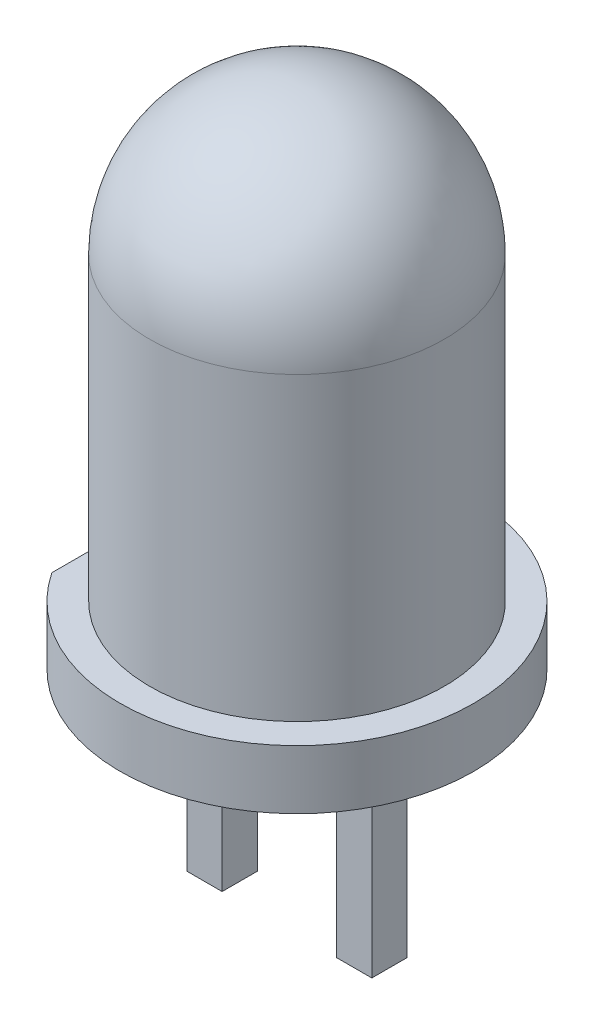
ISO-10303-21;
HEADER;
FILE_DESCRIPTION(('STEP AP214'),'2;1');
FILE_NAME('part.step','',(''),(''),'','','');
FILE_SCHEMA(('AUTOMOTIVE_DESIGN { 1 0 10303 214 1 1 1 1 }'));
ENDSEC;
DATA;
#1=APPLICATION_CONTEXT('core data for automotive mechanical design processes');
#2=APPLICATION_PROTOCOL_DEFINITION('international standard','automotive_design',2000,#1);
#3=PRODUCT_CONTEXT('',#1,'mechanical');
#4=PRODUCT('Part','Part','',(#3));
#5=PRODUCT_RELATED_PRODUCT_CATEGORY('part','',(#4));
#6=PRODUCT_DEFINITION_FORMATION('','',#4);
#7=PRODUCT_DEFINITION_CONTEXT('part definition',#1,'design');
#8=PRODUCT_DEFINITION('design','',#6,#7);
#9=PRODUCT_DEFINITION_SHAPE('','',#8);
#10=(LENGTH_UNIT() NAMED_UNIT(*) SI_UNIT(.MILLI.,.METRE.));
#11=(NAMED_UNIT(*) PLANE_ANGLE_UNIT() SI_UNIT($,.RADIAN.));
#12=(NAMED_UNIT(*) SI_UNIT($,.STERADIAN.) SOLID_ANGLE_UNIT());
#13=UNCERTAINTY_MEASURE_WITH_UNIT(LENGTH_MEASURE(1.E-05),#10,'distance_accuracy_value','');
#14=(GEOMETRIC_REPRESENTATION_CONTEXT(3) GLOBAL_UNCERTAINTY_ASSIGNED_CONTEXT((#13)) GLOBAL_UNIT_ASSIGNED_CONTEXT((#10,
#11,#12)) REPRESENTATION_CONTEXT('',''));
#15=CARTESIAN_POINT('',(0.,0.,0.));
#16=DIRECTION('',(0.,0.,1.));
#17=DIRECTION('',(1.,0.,0.));
#18=AXIS2_PLACEMENT_3D('',#15,#16,#17);
#19=CARTESIAN_POINT('',(0.,0.,0.));
#20=DIRECTION('',(0.,-1.,0.));
#21=DIRECTION('',(1.,0.,0.));
#22=AXIS2_PLACEMENT_3D('',#19,#20,#21);
#23=PLANE('',#22);
#24=DIRECTION('',(0.,0.,1.));
#25=VECTOR('',#24,1.);
#26=CARTESIAN_POINT('',(-2.5,0.,-2.));
#27=LINE('',#26,#25);
#28=CARTESIAN_POINT('',(-2.5,0.,-1.6583123951777));
#29=VERTEX_POINT('',#28);
#30=CARTESIAN_POINT('',(-2.5,0.,1.6583123951777));
#31=VERTEX_POINT('',#30);
#32=EDGE_CURVE('E124',#29,#31,#27,.T.);
#33=ORIENTED_EDGE('',*,*,#32,.F.);
#34=CARTESIAN_POINT('',(0.,0.,0.));
#35=DIRECTION('',(0.,1.,0.));
#36=DIRECTION('',(-1.,0.,0.));
#37=AXIS2_PLACEMENT_3D('',#34,#35,#36);
#38=CIRCLE('',#37,3.);
#39=EDGE_CURVE('E11',#31,#29,#38,.T.);
#40=ORIENTED_EDGE('',*,*,#39,.F.);
#41=EDGE_LOOP('',(#33,#40));
#42=FACE_BOUND('',#41,.T.);
#43=DIRECTION('',(-1.,0.,0.));
#44=VECTOR('',#43,1.);
#45=CARTESIAN_POINT('',(-1.57,0.,0.3));
#46=LINE('',#45,#44);
#47=CARTESIAN_POINT('',(-0.97,0.,0.3));
#48=VERTEX_POINT('',#47);
#49=CARTESIAN_POINT('',(-1.57,0.,0.3));
#50=VERTEX_POINT('',#49);
#51=EDGE_CURVE('E204',#48,#50,#46,.T.);
#52=ORIENTED_EDGE('',*,*,#51,.F.);
#53=DIRECTION('',(0.,0.,1.));
#54=VECTOR('',#53,1.);
#55=CARTESIAN_POINT('',(-0.97,0.,-0.3));
#56=LINE('',#55,#54);
#57=CARTESIAN_POINT('',(-0.97,0.,-0.3));
#58=VERTEX_POINT('',#57);
#59=EDGE_CURVE('E185',#58,#48,#56,.T.);
#60=ORIENTED_EDGE('',*,*,#59,.F.);
#61=DIRECTION('',(1.,0.,0.));
#62=VECTOR('',#61,1.);
#63=CARTESIAN_POINT('',(-1.57,0.,-0.3));
#64=LINE('',#63,#62);
#65=CARTESIAN_POINT('',(-1.57,0.,-0.3));
#66=VERTEX_POINT('',#65);
#67=EDGE_CURVE('E191',#66,#58,#64,.T.);
#68=ORIENTED_EDGE('',*,*,#67,.F.);
#69=DIRECTION('',(0.,0.,-1.));
#70=VECTOR('',#69,1.);
#71=CARTESIAN_POINT('',(-1.57,0.,-0.3));
#72=LINE('',#71,#70);
#73=EDGE_CURVE('E207',#50,#66,#72,.T.);
#74=ORIENTED_EDGE('',*,*,#73,.F.);
#75=EDGE_LOOP('',(#52,#60,#68,#74));
#76=FACE_BOUND('',#75,.T.);
#77=DIRECTION('',(-1.,0.,0.));
#78=VECTOR('',#77,1.);
#79=CARTESIAN_POINT('',(0.97,0.,0.3));
#80=LINE('',#79,#78);
#81=CARTESIAN_POINT('',(1.57,0.,0.3));
#82=VERTEX_POINT('',#81);
#83=CARTESIAN_POINT('',(0.97,0.,0.3));
#84=VERTEX_POINT('',#83);
#85=EDGE_CURVE('E146',#82,#84,#80,.T.);
#86=ORIENTED_EDGE('',*,*,#85,.F.);
#87=DIRECTION('',(0.,0.,1.));
#88=VECTOR('',#87,1.);
#89=CARTESIAN_POINT('',(1.57,0.,-0.3));
#90=LINE('',#89,#88);
#91=CARTESIAN_POINT('',(1.57,0.,-0.3));
#92=VERTEX_POINT('',#91);
#93=EDGE_CURVE('E140',#92,#82,#90,.T.);
#94=ORIENTED_EDGE('',*,*,#93,.F.);
#95=DIRECTION('',(1.,0.,0.));
#96=VECTOR('',#95,1.);
#97=CARTESIAN_POINT('',(0.97,0.,-0.3));
#98=LINE('',#97,#96);
#99=CARTESIAN_POINT('',(0.97,0.,-0.3));
#100=VERTEX_POINT('',#99);
#101=EDGE_CURVE('E156',#100,#92,#98,.T.);
#102=ORIENTED_EDGE('',*,*,#101,.F.);
#103=DIRECTION('',(0.,0.,-1.));
#104=VECTOR('',#103,1.);
#105=CARTESIAN_POINT('',(0.97,0.,-0.3));
#106=LINE('',#105,#104);
#107=EDGE_CURVE('E168',#84,#100,#106,.T.);
#108=ORIENTED_EDGE('',*,*,#107,.F.);
#109=EDGE_LOOP('',(#86,#94,#102,#108));
#110=FACE_BOUND('',#109,.T.);
#111=ADVANCED_FACE('F42',(#42,#76,#110),#23,.T.);
#112=CARTESIAN_POINT('',(0.,8.6,0.));
#113=DIRECTION('',(0.,1.,0.));
#114=DIRECTION('',(-1.,0.,0.));
#115=AXIS2_PLACEMENT_3D('',#112,#113,#114);
#116=CYLINDRICAL_SURFACE('',#115,3.);
#117=DIRECTION('',(0.,1.,0.));
#118=VECTOR('',#117,1.);
#119=CARTESIAN_POINT('',(-2.5,8.6,-1.6583123951777));
#120=LINE('',#119,#118);
#121=CARTESIAN_POINT('',(-2.5,0.999999999999999,-1.6583123951777));
#122=VERTEX_POINT('',#121);
#123=EDGE_CURVE('E121',#122,#29,#120,.F.);
#124=ORIENTED_EDGE('',*,*,#123,.F.);
#125=CARTESIAN_POINT('',(0.,0.999999999999999,0.));
#126=DIRECTION('',(0.,1.,0.));
#127=DIRECTION('',(-1.,0.,0.));
#128=AXIS2_PLACEMENT_3D('',#125,#126,#127);
#129=CIRCLE('',#128,3.);
#130=CARTESIAN_POINT('',(-2.5,0.999999999999999,1.6583123951777));
#131=VERTEX_POINT('',#130);
#132=EDGE_CURVE('E50',#131,#122,#129,.T.);
#133=ORIENTED_EDGE('',*,*,#132,.F.);
#134=DIRECTION('',(0.,1.,0.));
#135=VECTOR('',#134,1.);
#136=CARTESIAN_POINT('',(-2.5,8.6,1.6583123951777));
#137=LINE('',#136,#135);
#138=EDGE_CURVE('E138',#31,#131,#137,.T.);
#139=ORIENTED_EDGE('',*,*,#138,.F.);
#140=ORIENTED_EDGE('',*,*,#39,.T.);
#141=EDGE_LOOP('',(#124,#133,#139,#140));
#142=FACE_BOUND('',#141,.T.);
#143=ADVANCED_FACE('F137',(#142),#116,.T.);
#144=CARTESIAN_POINT('',(-3.,1.,0.));
#145=DIRECTION('',(0.,1.,0.));
#146=DIRECTION('',(-1.,0.,0.));
#147=AXIS2_PLACEMENT_3D('',#144,#145,#146);
#148=PLANE('',#147);
#149=DIRECTION('',(0.,0.,-1.));
#150=VECTOR('',#149,1.);
#151=CARTESIAN_POINT('',(-2.5,1.,0.));
#152=LINE('',#151,#150);
#153=CARTESIAN_POINT('',(-2.5,0.999999999999999,0.));
#154=VERTEX_POINT('',#153);
#155=EDGE_CURVE('E57',#131,#154,#152,.T.);
#156=ORIENTED_EDGE('',*,*,#155,.F.);
#157=ORIENTED_EDGE('',*,*,#132,.T.);
#158=EDGE_CURVE('E126',#154,#122,#152,.T.);
#159=ORIENTED_EDGE('',*,*,#158,.F.);
#160=CARTESIAN_POINT('',(0.,0.999999999999999,0.));
#161=DIRECTION('',(0.,1.,0.));
#162=DIRECTION('',(-1.,0.,0.));
#163=AXIS2_PLACEMENT_3D('',#160,#161,#162);
#164=CIRCLE('',#163,2.5);
#165=EDGE_CURVE('E228',#154,#154,#164,.T.);
#166=ORIENTED_EDGE('',*,*,#165,.F.);
#167=EDGE_LOOP('',(#156,#157,#159,#166));
#168=FACE_BOUND('',#167,.T.);
#169=ADVANCED_FACE('F233',(#168),#148,.T.);
#170=CARTESIAN_POINT('',(0.,8.6,0.));
#171=DIRECTION('',(0.,1.,0.));
#172=DIRECTION('',(-1.,0.,0.));
#173=AXIS2_PLACEMENT_3D('',#170,#171,#172);
#174=CYLINDRICAL_SURFACE('',#173,2.5);
#175=ORIENTED_EDGE('',*,*,#165,.T.);
#176=EDGE_LOOP('',(#175));
#177=FACE_BOUND('',#176,.T.);
#178=CARTESIAN_POINT('',(0.,6.1,0.));
#179=DIRECTION('',(0.,1.,0.));
#180=DIRECTION('',(-1.,0.,0.));
#181=AXIS2_PLACEMENT_3D('',#178,#179,#180);
#182=CIRCLE('',#181,2.5);
#183=CARTESIAN_POINT('',(-2.5,6.1,0.));
#184=VERTEX_POINT('',#183);
#185=EDGE_CURVE('E225',#184,#184,#182,.T.);
#186=ORIENTED_EDGE('',*,*,#185,.F.);
#187=EDGE_LOOP('',(#186));
#188=FACE_BOUND('',#187,.T.);
#189=ADVANCED_FACE('F236',(#177,#188),#174,.T.);
#190=CARTESIAN_POINT('',(0.,6.1,0.));
#191=DIRECTION('',(0.,1.,0.));
#192=DIRECTION('',(-1.,0.,0.));
#193=AXIS2_PLACEMENT_3D('',#190,#191,#192);
#194=SPHERICAL_SURFACE('',#193,2.5);
#195=ORIENTED_EDGE('',*,*,#185,.T.);
#196=EDGE_LOOP('',(#195));
#197=FACE_BOUND('',#196,.T.);
#198=ADVANCED_FACE('F239',(#197),#194,.T.);
#199=CARTESIAN_POINT('',(-0.97,-3.6,-0.3));
#200=DIRECTION('',(-1.,0.,0.));
#201=DIRECTION('',(0.,-1.,0.));
#202=AXIS2_PLACEMENT_3D('',#199,#200,#201);
#203=PLANE('',#202);
#204=ORIENTED_EDGE('',*,*,#59,.T.);
#205=DIRECTION('',(0.,1.,0.));
#206=VECTOR('',#205,1.);
#207=CARTESIAN_POINT('',(-0.97,-3.6,0.3));
#208=LINE('',#207,#206);
#209=CARTESIAN_POINT('',(-0.97,-3.6,0.3));
#210=VERTEX_POINT('',#209);
#211=EDGE_CURVE('E222',#210,#48,#208,.T.);
#212=ORIENTED_EDGE('',*,*,#211,.F.);
#213=DIRECTION('',(0.,0.,1.));
#214=VECTOR('',#213,1.);
#215=CARTESIAN_POINT('',(-0.97,-3.6,-0.3));
#216=LINE('',#215,#214);
#217=CARTESIAN_POINT('',(-0.97,-3.6,-0.3));
#218=VERTEX_POINT('',#217);
#219=EDGE_CURVE('E186',#218,#210,#216,.T.);
#220=ORIENTED_EDGE('',*,*,#219,.F.);
#221=DIRECTION('',(0.,1.,0.));
#222=VECTOR('',#221,1.);
#223=CARTESIAN_POINT('',(-0.97,-3.6,-0.3));
#224=LINE('',#223,#222);
#225=EDGE_CURVE('E200',#218,#58,#224,.T.);
#226=ORIENTED_EDGE('',*,*,#225,.T.);
#227=EDGE_LOOP('',(#204,#212,#220,#226));
#228=FACE_BOUND('',#227,.T.);
#229=ADVANCED_FACE('F244',(#228),#203,.F.);
#230=CARTESIAN_POINT('',(-1.57,-3.6,0.3));
#231=DIRECTION('',(0.,0.,-1.));
#232=DIRECTION('',(-1.,0.,0.));
#233=AXIS2_PLACEMENT_3D('',#230,#231,#232);
#234=PLANE('',#233);
#235=ORIENTED_EDGE('',*,*,#51,.T.);
#236=DIRECTION('',(0.,1.,0.));
#237=VECTOR('',#236,1.);
#238=CARTESIAN_POINT('',(-1.57,-3.6,0.3));
#239=LINE('',#238,#237);
#240=CARTESIAN_POINT('',(-1.57,-3.6,0.3));
#241=VERTEX_POINT('',#240);
#242=EDGE_CURVE('E218',#241,#50,#239,.T.);
#243=ORIENTED_EDGE('',*,*,#242,.F.);
#244=DIRECTION('',(-1.,0.,0.));
#245=VECTOR('',#244,1.);
#246=CARTESIAN_POINT('',(-1.57,-3.6,0.3));
#247=LINE('',#246,#245);
#248=EDGE_CURVE('E190',#210,#241,#247,.T.);
#249=ORIENTED_EDGE('',*,*,#248,.F.);
#250=ORIENTED_EDGE('',*,*,#211,.T.);
#251=EDGE_LOOP('',(#235,#243,#249,#250));
#252=FACE_BOUND('',#251,.T.);
#253=ADVANCED_FACE('F249',(#252),#234,.F.);
#254=CARTESIAN_POINT('',(-1.57,-3.6,-0.3));
#255=DIRECTION('',(1.,0.,0.));
#256=DIRECTION('',(0.,1.,0.));
#257=AXIS2_PLACEMENT_3D('',#254,#255,#256);
#258=PLANE('',#257);
#259=ORIENTED_EDGE('',*,*,#73,.T.);
#260=DIRECTION('',(0.,1.,0.));
#261=VECTOR('',#260,1.);
#262=CARTESIAN_POINT('',(-1.57,-3.6,-0.3));
#263=LINE('',#262,#261);
#264=CARTESIAN_POINT('',(-1.57,-3.6,-0.3));
#265=VERTEX_POINT('',#264);
#266=EDGE_CURVE('E215',#265,#66,#263,.T.);
#267=ORIENTED_EDGE('',*,*,#266,.F.);
#268=DIRECTION('',(0.,0.,-1.));
#269=VECTOR('',#268,1.);
#270=CARTESIAN_POINT('',(-1.57,-3.6,-0.3));
#271=LINE('',#270,#269);
#272=EDGE_CURVE('E194',#241,#265,#271,.T.);
#273=ORIENTED_EDGE('',*,*,#272,.F.);
#274=ORIENTED_EDGE('',*,*,#242,.T.);
#275=EDGE_LOOP('',(#259,#267,#273,#274));
#276=FACE_BOUND('',#275,.T.);
#277=ADVANCED_FACE('F281',(#276),#258,.F.);
#278=CARTESIAN_POINT('',(-1.57,-3.6,-0.3));
#279=DIRECTION('',(0.,0.,1.));
#280=DIRECTION('',(1.,0.,0.));
#281=AXIS2_PLACEMENT_3D('',#278,#279,#280);
#282=PLANE('',#281);
#283=ORIENTED_EDGE('',*,*,#67,.T.);
#284=ORIENTED_EDGE('',*,*,#225,.F.);
#285=DIRECTION('',(1.,0.,0.));
#286=VECTOR('',#285,1.);
#287=CARTESIAN_POINT('',(-1.57,-3.6,-0.3));
#288=LINE('',#287,#286);
#289=EDGE_CURVE('E197',#265,#218,#288,.T.);
#290=ORIENTED_EDGE('',*,*,#289,.F.);
#291=ORIENTED_EDGE('',*,*,#266,.T.);
#292=EDGE_LOOP('',(#283,#284,#290,#291));
#293=FACE_BOUND('',#292,.T.);
#294=ADVANCED_FACE('F290',(#293),#282,.F.);
#295=CARTESIAN_POINT('',(0.,-3.6,0.));
#296=DIRECTION('',(0.,1.,0.));
#297=DIRECTION('',(-1.,0.,0.));
#298=AXIS2_PLACEMENT_3D('',#295,#296,#297);
#299=PLANE('',#298);
#300=ORIENTED_EDGE('',*,*,#219,.T.);
#301=ORIENTED_EDGE('',*,*,#248,.T.);
#302=ORIENTED_EDGE('',*,*,#272,.T.);
#303=ORIENTED_EDGE('',*,*,#289,.T.);
#304=EDGE_LOOP('',(#300,#301,#302,#303));
#305=FACE_BOUND('',#304,.T.);
#306=ADVANCED_FACE('F299',(#305),#299,.F.);
#307=CARTESIAN_POINT('',(1.57,-3.6,-0.3));
#308=DIRECTION('',(-1.,0.,0.));
#309=DIRECTION('',(0.,-1.,0.));
#310=AXIS2_PLACEMENT_3D('',#307,#308,#309);
#311=PLANE('',#310);
#312=ORIENTED_EDGE('',*,*,#93,.T.);
#313=DIRECTION('',(0.,1.,0.));
#314=VECTOR('',#313,1.);
#315=CARTESIAN_POINT('',(1.57,-3.6,0.3));
#316=LINE('',#315,#314);
#317=CARTESIAN_POINT('',(1.57,-3.6,0.3));
#318=VERTEX_POINT('',#317);
#319=EDGE_CURVE('E182',#318,#82,#316,.T.);
#320=ORIENTED_EDGE('',*,*,#319,.F.);
#321=DIRECTION('',(0.,0.,1.));
#322=VECTOR('',#321,1.);
#323=CARTESIAN_POINT('',(1.57,-3.6,-0.3));
#324=LINE('',#323,#322);
#325=CARTESIAN_POINT('',(1.57,-3.6,-0.3));
#326=VERTEX_POINT('',#325);
#327=EDGE_CURVE('E151',#326,#318,#324,.T.);
#328=ORIENTED_EDGE('',*,*,#327,.F.);
#329=DIRECTION('',(0.,1.,0.));
#330=VECTOR('',#329,1.);
#331=CARTESIAN_POINT('',(1.57,-3.6,-0.3));
#332=LINE('',#331,#330);
#333=EDGE_CURVE('E164',#326,#92,#332,.T.);
#334=ORIENTED_EDGE('',*,*,#333,.T.);
#335=EDGE_LOOP('',(#312,#320,#328,#334));
#336=FACE_BOUND('',#335,.T.);
#337=ADVANCED_FACE('F308',(#336),#311,.F.);
#338=CARTESIAN_POINT('',(0.97,-3.6,0.3));
#339=DIRECTION('',(0.,0.,-1.));
#340=DIRECTION('',(-1.,0.,0.));
#341=AXIS2_PLACEMENT_3D('',#338,#339,#340);
#342=PLANE('',#341);
#343=ORIENTED_EDGE('',*,*,#85,.T.);
#344=DIRECTION('',(0.,1.,0.));
#345=VECTOR('',#344,1.);
#346=CARTESIAN_POINT('',(0.97,-3.6,0.3));
#347=LINE('',#346,#345);
#348=CARTESIAN_POINT('',(0.97,-3.6,0.3));
#349=VERTEX_POINT('',#348);
#350=EDGE_CURVE('E178',#349,#84,#347,.T.);
#351=ORIENTED_EDGE('',*,*,#350,.F.);
#352=DIRECTION('',(-1.,0.,0.));
#353=VECTOR('',#352,1.);
#354=CARTESIAN_POINT('',(0.97,-3.6,0.3));
#355=LINE('',#354,#353);
#356=EDGE_CURVE('E155',#318,#349,#355,.T.);
#357=ORIENTED_EDGE('',*,*,#356,.F.);
#358=ORIENTED_EDGE('',*,*,#319,.T.);
#359=EDGE_LOOP('',(#343,#351,#357,#358));
#360=FACE_BOUND('',#359,.T.);
#361=ADVANCED_FACE('F317',(#360),#342,.F.);
#362=CARTESIAN_POINT('',(0.97,-3.6,-0.3));
#363=DIRECTION('',(1.,0.,0.));
#364=DIRECTION('',(0.,1.,0.));
#365=AXIS2_PLACEMENT_3D('',#362,#363,#364);
#366=PLANE('',#365);
#367=ORIENTED_EDGE('',*,*,#107,.T.);
#368=DIRECTION('',(0.,1.,0.));
#369=VECTOR('',#368,1.);
#370=CARTESIAN_POINT('',(0.97,-3.6,-0.3));
#371=LINE('',#370,#369);
#372=CARTESIAN_POINT('',(0.97,-3.6,-0.3));
#373=VERTEX_POINT('',#372);
#374=EDGE_CURVE('E65',#373,#100,#371,.T.);
#375=ORIENTED_EDGE('',*,*,#374,.F.);
#376=DIRECTION('',(0.,0.,-1.));
#377=VECTOR('',#376,1.);
#378=CARTESIAN_POINT('',(0.97,-3.6,-0.3));
#379=LINE('',#378,#377);
#380=EDGE_CURVE('E159',#349,#373,#379,.T.);
#381=ORIENTED_EDGE('',*,*,#380,.F.);
#382=ORIENTED_EDGE('',*,*,#350,.T.);
#383=EDGE_LOOP('',(#367,#375,#381,#382));
#384=FACE_BOUND('',#383,.T.);
#385=ADVANCED_FACE('F326',(#384),#366,.F.);
#386=CARTESIAN_POINT('',(0.97,-3.6,-0.3));
#387=DIRECTION('',(0.,0.,1.));
#388=DIRECTION('',(1.,0.,0.));
#389=AXIS2_PLACEMENT_3D('',#386,#387,#388);
#390=PLANE('',#389);
#391=ORIENTED_EDGE('',*,*,#101,.T.);
#392=ORIENTED_EDGE('',*,*,#333,.F.);
#393=DIRECTION('',(1.,0.,0.));
#394=VECTOR('',#393,1.);
#395=CARTESIAN_POINT('',(0.97,-3.6,-0.3));
#396=LINE('',#395,#394);
#397=EDGE_CURVE('E162',#373,#326,#396,.T.);
#398=ORIENTED_EDGE('',*,*,#397,.F.);
#399=ORIENTED_EDGE('',*,*,#374,.T.);
#400=EDGE_LOOP('',(#391,#392,#398,#399));
#401=FACE_BOUND('',#400,.T.);
#402=ADVANCED_FACE('F335',(#401),#390,.F.);
#403=CARTESIAN_POINT('',(0.,-3.6,0.));
#404=DIRECTION('',(0.,1.,0.));
#405=DIRECTION('',(-1.,0.,0.));
#406=AXIS2_PLACEMENT_3D('',#403,#404,#405);
#407=PLANE('',#406);
#408=ORIENTED_EDGE('',*,*,#327,.T.);
#409=ORIENTED_EDGE('',*,*,#356,.T.);
#410=ORIENTED_EDGE('',*,*,#380,.T.);
#411=ORIENTED_EDGE('',*,*,#397,.T.);
#412=EDGE_LOOP('',(#408,#409,#410,#411));
#413=FACE_BOUND('',#412,.T.);
#414=ADVANCED_FACE('F344',(#413),#407,.F.);
#415=CARTESIAN_POINT('',(-2.5,8.6,-2.));
#416=DIRECTION('',(1.,0.,0.));
#417=DIRECTION('',(0.,1.,0.));
#418=AXIS2_PLACEMENT_3D('',#415,#416,#417);
#419=PLANE('',#418);
#420=ORIENTED_EDGE('',*,*,#138,.T.);
#421=ORIENTED_EDGE('',*,*,#155,.T.);
#422=ORIENTED_EDGE('',*,*,#158,.T.);
#423=ORIENTED_EDGE('',*,*,#123,.T.);
#424=ORIENTED_EDGE('',*,*,#32,.T.);
#425=EDGE_LOOP('',(#420,#421,#422,#423,#424));
#426=FACE_BOUND('',#425,.T.);
#427=ADVANCED_FACE('F123',(#426),#419,.F.);
#428=CLOSED_SHELL('',(#111,#143,#169,#189,#198,#229,#253,#277,#294,#306,#337,#361,#385,#402,
#414,#427));
#429=MANIFOLD_SOLID_BREP('B2',#428);
#430=ADVANCED_BREP_SHAPE_REPRESENTATION('',(#18,#429),#14);
#431=SHAPE_DEFINITION_REPRESENTATION(#9,#430);
ENDSEC;
END-ISO-10303-21;
